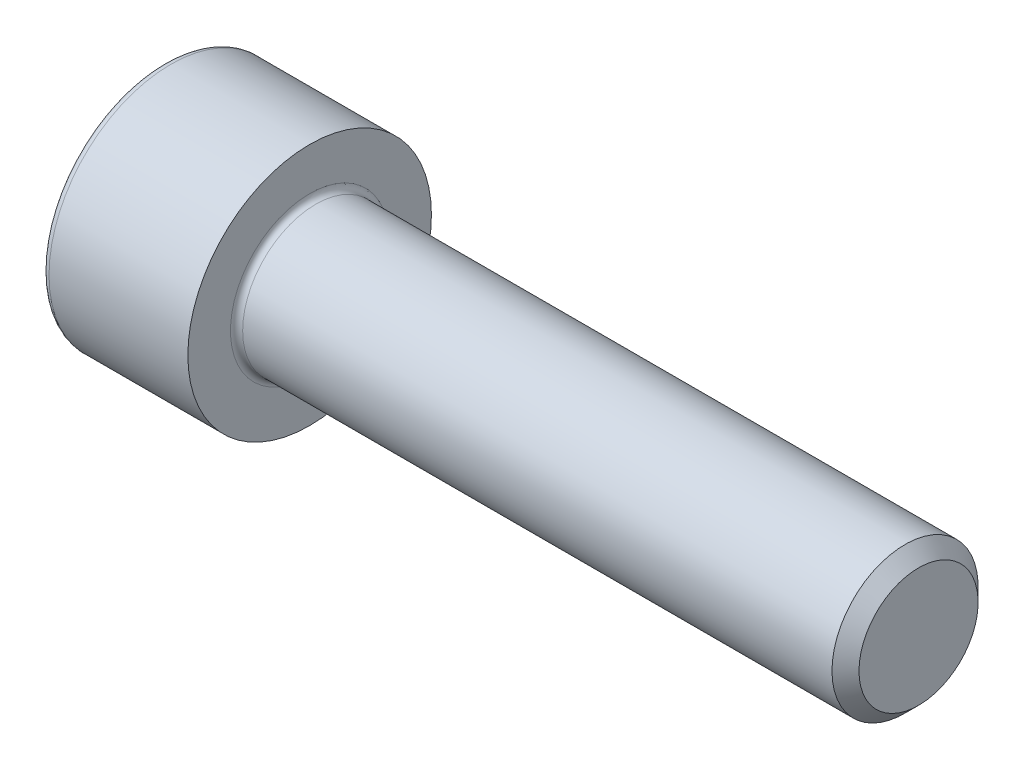
ISO-10303-21;
HEADER;
FILE_DESCRIPTION(('STEP AP214'),'2;1');
FILE_NAME('part.step','',(''),(''),'','','');
FILE_SCHEMA(('AUTOMOTIVE_DESIGN { 1 0 10303 214 1 1 1 1 }'));
ENDSEC;
DATA;
#1=APPLICATION_CONTEXT('core data for automotive mechanical design processes');
#2=APPLICATION_PROTOCOL_DEFINITION('international standard','automotive_design',2000,#1);
#3=PRODUCT_CONTEXT('',#1,'mechanical');
#4=PRODUCT('Part','Part','',(#3));
#5=PRODUCT_RELATED_PRODUCT_CATEGORY('part','',(#4));
#6=PRODUCT_DEFINITION_FORMATION('','',#4);
#7=PRODUCT_DEFINITION_CONTEXT('part definition',#1,'design');
#8=PRODUCT_DEFINITION('design','',#6,#7);
#9=PRODUCT_DEFINITION_SHAPE('','',#8);
#10=(LENGTH_UNIT() NAMED_UNIT(*) SI_UNIT(.MILLI.,.METRE.));
#11=(NAMED_UNIT(*) PLANE_ANGLE_UNIT() SI_UNIT($,.RADIAN.));
#12=(NAMED_UNIT(*) SI_UNIT($,.STERADIAN.) SOLID_ANGLE_UNIT());
#13=UNCERTAINTY_MEASURE_WITH_UNIT(LENGTH_MEASURE(1.E-05),#10,'distance_accuracy_value','');
#14=(GEOMETRIC_REPRESENTATION_CONTEXT(3) GLOBAL_UNCERTAINTY_ASSIGNED_CONTEXT((#13)) GLOBAL_UNIT_ASSIGNED_CONTEXT((#10,
#11,#12)) REPRESENTATION_CONTEXT('',''));
#15=CARTESIAN_POINT('',(0.,0.,0.));
#16=DIRECTION('',(0.,0.,1.));
#17=DIRECTION('',(1.,0.,0.));
#18=AXIS2_PLACEMENT_3D('',#15,#16,#17);
#19=CARTESIAN_POINT('',(0.,0.,0.));
#20=DIRECTION('',(-1.,0.,0.));
#21=DIRECTION('',(0.,0.,1.));
#22=AXIS2_PLACEMENT_3D('',#19,#20,#21);
#23=PLANE('',#22);
#24=DIRECTION('',(0.,-0.499999999999999,0.866025403784439));
#25=VECTOR('',#24,1.);
#26=CARTESIAN_POINT('',(0.,2.93524876856005,0.));
#27=LINE('',#26,#25);
#28=CARTESIAN_POINT('',(0.,2.93524876856005,0.));
#29=VERTEX_POINT('',#28);
#30=CARTESIAN_POINT('',(0.,1.46762438428003,2.54199999999999));
#31=VERTEX_POINT('',#30);
#32=EDGE_CURVE('E260',#29,#31,#27,.T.);
#33=ORIENTED_EDGE('',*,*,#32,.T.);
#34=DIRECTION('',(0.,1.,0.));
#35=VECTOR('',#34,1.);
#36=CARTESIAN_POINT('',(0.,-1.46762438428003,2.542));
#37=LINE('',#36,#35);
#38=CARTESIAN_POINT('',(0.,-1.46762438428003,2.542));
#39=VERTEX_POINT('',#38);
#40=EDGE_CURVE('E132',#39,#31,#37,.T.);
#41=ORIENTED_EDGE('',*,*,#40,.F.);
#42=DIRECTION('',(0.,-0.500000000000001,-0.866025403784438));
#43=VECTOR('',#42,1.);
#44=CARTESIAN_POINT('',(0.,-1.46762438428003,2.542));
#45=LINE('',#44,#43);
#46=CARTESIAN_POINT('',(0.,-2.93524876856006,0.));
#47=VERTEX_POINT('',#46);
#48=EDGE_CURVE('E263',#39,#47,#45,.T.);
#49=ORIENTED_EDGE('',*,*,#48,.T.);
#50=DIRECTION('',(0.,0.499999999999999,-0.866025403784439));
#51=VECTOR('',#50,1.);
#52=CARTESIAN_POINT('',(0.,-2.93524876856006,0.));
#53=LINE('',#52,#51);
#54=CARTESIAN_POINT('',(0.,-1.46762438428004,-2.542));
#55=VERTEX_POINT('',#54);
#56=EDGE_CURVE('E266',#47,#55,#53,.T.);
#57=ORIENTED_EDGE('',*,*,#56,.T.);
#58=DIRECTION('',(0.,-1.,0.));
#59=VECTOR('',#58,1.);
#60=CARTESIAN_POINT('',(0.,1.46762438428002,-2.542));
#61=LINE('',#60,#59);
#62=CARTESIAN_POINT('',(0.,1.46762438428002,-2.542));
#63=VERTEX_POINT('',#62);
#64=EDGE_CURVE('E269',#63,#55,#61,.T.);
#65=ORIENTED_EDGE('',*,*,#64,.F.);
#66=DIRECTION('',(0.,-0.500000000000001,-0.866025403784438));
#67=VECTOR('',#66,1.);
#68=CARTESIAN_POINT('',(0.,2.93524876856005,0.));
#69=LINE('',#68,#67);
#70=EDGE_CURVE('E127',#29,#63,#69,.T.);
#71=ORIENTED_EDGE('',*,*,#70,.F.);
#72=EDGE_LOOP('',(#33,#41,#49,#57,#65,#71));
#73=FACE_BOUND('',#72,.T.);
#74=CARTESIAN_POINT('',(0.,0.,0.));
#75=DIRECTION('',(-1.,0.,0.));
#76=DIRECTION('',(0.,0.,1.));
#77=AXIS2_PLACEMENT_3D('',#74,#75,#76);
#78=CIRCLE('',#77,4.7);
#79=CARTESIAN_POINT('',(0.,0.,4.7));
#80=VERTEX_POINT('',#79);
#81=EDGE_CURVE('E44',#80,#80,#78,.T.);
#82=ORIENTED_EDGE('',*,*,#81,.T.);
#83=EDGE_LOOP('',(#82));
#84=FACE_BOUND('',#83,.T.);
#85=ADVANCED_FACE('F36',(#73,#84),#23,.T.);
#86=CARTESIAN_POINT('',(-31.75,0.,0.));
#87=DIRECTION('',(-1.,0.,0.));
#88=DIRECTION('',(0.,0.,1.));
#89=AXIS2_PLACEMENT_3D('',#86,#87,#88);
#90=CYLINDRICAL_SURFACE('',#89,5.);
#91=CARTESIAN_POINT('',(0.300000000000002,0.,0.));
#92=DIRECTION('',(-1.,0.,0.));
#93=DIRECTION('',(0.,0.,1.));
#94=AXIS2_PLACEMENT_3D('',#91,#92,#93);
#95=CIRCLE('',#94,5.);
#96=CARTESIAN_POINT('',(0.300000000000002,0.,5.));
#97=VERTEX_POINT('',#96);
#98=EDGE_CURVE('E11',#97,#97,#95,.F.);
#99=ORIENTED_EDGE('',*,*,#98,.T.);
#100=EDGE_LOOP('',(#99));
#101=FACE_BOUND('',#100,.T.);
#102=CARTESIAN_POINT('',(6.,0.,0.));
#103=DIRECTION('',(-1.,0.,0.));
#104=DIRECTION('',(0.,0.,1.));
#105=AXIS2_PLACEMENT_3D('',#102,#103,#104);
#106=CIRCLE('',#105,5.);
#107=CARTESIAN_POINT('',(6.,0.,5.));
#108=VERTEX_POINT('',#107);
#109=EDGE_CURVE('E150',#108,#108,#106,.T.);
#110=ORIENTED_EDGE('',*,*,#109,.T.);
#111=EDGE_LOOP('',(#110));
#112=FACE_BOUND('',#111,.T.);
#113=ADVANCED_FACE('F174',(#101,#112),#90,.T.);
#114=CARTESIAN_POINT('',(6.,5.,0.));
#115=DIRECTION('',(1.,0.,0.));
#116=DIRECTION('',(0.,0.,-1.));
#117=AXIS2_PLACEMENT_3D('',#114,#115,#116);
#118=PLANE('',#117);
#119=CARTESIAN_POINT('',(6.,0.,0.));
#120=DIRECTION('',(1.,0.,0.));
#121=DIRECTION('',(0.,0.,-1.));
#122=AXIS2_PLACEMENT_3D('',#119,#120,#121);
#123=CIRCLE('',#122,3.24999999999998);
#124=CARTESIAN_POINT('',(6.,0.,-3.24999999999998));
#125=VERTEX_POINT('',#124);
#126=EDGE_CURVE('E153',#125,#125,#123,.F.);
#127=ORIENTED_EDGE('',*,*,#126,.T.);
#128=EDGE_LOOP('',(#127));
#129=FACE_BOUND('',#128,.T.);
#130=ORIENTED_EDGE('',*,*,#109,.F.);
#131=EDGE_LOOP('',(#130));
#132=FACE_BOUND('',#131,.T.);
#133=ADVANCED_FACE('F180',(#129,#132),#118,.T.);
#134=CARTESIAN_POINT('',(-31.75,0.,0.));
#135=DIRECTION('',(-1.,0.,0.));
#136=DIRECTION('',(0.,0.,1.));
#137=AXIS2_PLACEMENT_3D('',#134,#135,#136);
#138=CYLINDRICAL_SURFACE('',#137,2.99999999999998);
#139=CARTESIAN_POINT('',(6.25,0.,0.));
#140=DIRECTION('',(1.,0.,0.));
#141=DIRECTION('',(0.,0.,-1.));
#142=AXIS2_PLACEMENT_3D('',#139,#140,#141);
#143=CIRCLE('',#142,2.99999999999998);
#144=CARTESIAN_POINT('',(6.25,0.,-2.99999999999998));
#145=VERTEX_POINT('',#144);
#146=EDGE_CURVE('E156',#145,#145,#143,.T.);
#147=ORIENTED_EDGE('',*,*,#146,.T.);
#148=EDGE_LOOP('',(#147));
#149=FACE_BOUND('',#148,.T.);
#150=CARTESIAN_POINT('',(30.4455,0.,0.));
#151=DIRECTION('',(-1.,0.,0.));
#152=DIRECTION('',(0.,0.,1.));
#153=AXIS2_PLACEMENT_3D('',#150,#151,#152);
#154=CIRCLE('',#153,2.99999999999995);
#155=CARTESIAN_POINT('',(30.4455,0.,2.99999999999995));
#156=VERTEX_POINT('',#155);
#157=EDGE_CURVE('E147',#156,#156,#154,.T.);
#158=ORIENTED_EDGE('',*,*,#157,.T.);
#159=EDGE_LOOP('',(#158));
#160=FACE_BOUND('',#159,.T.);
#161=ADVANCED_FACE('F186',(#149,#160),#138,.T.);
#162=CARTESIAN_POINT('',(31.,0.,0.));
#163=DIRECTION('',(-1.,0.,0.));
#164=DIRECTION('',(0.,0.,1.));
#165=AXIS2_PLACEMENT_3D('',#162,#163,#164);
#166=CONICAL_SURFACE('',#165,2.4455,0.785398163397388);
#167=ORIENTED_EDGE('',*,*,#157,.F.);
#168=EDGE_LOOP('',(#167));
#169=FACE_BOUND('',#168,.T.);
#170=CARTESIAN_POINT('',(31.,0.,0.));
#171=DIRECTION('',(-1.,0.,0.));
#172=DIRECTION('',(0.,0.,1.));
#173=AXIS2_PLACEMENT_3D('',#170,#171,#172);
#174=CIRCLE('',#173,2.4455);
#175=CARTESIAN_POINT('',(31.,0.,2.4455));
#176=VERTEX_POINT('',#175);
#177=EDGE_CURVE('E143',#176,#176,#174,.T.);
#178=ORIENTED_EDGE('',*,*,#177,.T.);
#179=EDGE_LOOP('',(#178));
#180=FACE_BOUND('',#179,.T.);
#181=ADVANCED_FACE('F190',(#169,#180),#166,.T.);
#182=CARTESIAN_POINT('',(31.,2.4455,0.));
#183=DIRECTION('',(1.,0.,0.));
#184=DIRECTION('',(0.,0.,-1.));
#185=AXIS2_PLACEMENT_3D('',#182,#183,#184);
#186=PLANE('',#185);
#187=ORIENTED_EDGE('',*,*,#177,.F.);
#188=EDGE_LOOP('',(#187));
#189=FACE_BOUND('',#188,.T.);
#190=ADVANCED_FACE('F170',(#189),#186,.T.);
#191=CARTESIAN_POINT('',(6.25,0.,0.));
#192=DIRECTION('',(1.,0.,0.));
#193=DIRECTION('',(0.,0.,-1.));
#194=AXIS2_PLACEMENT_3D('',#191,#192,#193);
#195=TOROIDAL_SURFACE('',#194,3.24999999999998,0.25);
#196=ORIENTED_EDGE('',*,*,#146,.F.);
#197=EDGE_LOOP('',(#196));
#198=FACE_BOUND('',#197,.T.);
#199=ORIENTED_EDGE('',*,*,#126,.F.);
#200=EDGE_LOOP('',(#199));
#201=FACE_BOUND('',#200,.T.);
#202=ADVANCED_FACE('F163',(#198,#201),#195,.F.);
#203=CARTESIAN_POINT('',(0.300000000000002,0.,0.));
#204=DIRECTION('',(-1.,0.,0.));
#205=DIRECTION('',(0.,0.,1.));
#206=AXIS2_PLACEMENT_3D('',#203,#204,#205);
#207=TOROIDAL_SURFACE('',#206,4.7,0.3);
#208=ORIENTED_EDGE('',*,*,#98,.F.);
#209=EDGE_LOOP('',(#208));
#210=FACE_BOUND('',#209,.T.);
#211=ORIENTED_EDGE('',*,*,#81,.F.);
#212=EDGE_LOOP('',(#211));
#213=FACE_BOUND('',#212,.T.);
#214=ADVANCED_FACE('F38',(#210,#213),#207,.T.);
#215=CARTESIAN_POINT('',(3.,2.93524876856005,0.));
#216=DIRECTION('',(0.,-0.866025403784439,-0.499999999999999));
#217=DIRECTION('',(0.,0.499999999999999,-0.866025403784439));
#218=AXIS2_PLACEMENT_3D('',#215,#216,#217);
#219=PLANE('',#218);
#220=ORIENTED_EDGE('',*,*,#32,.F.);
#221=DIRECTION('',(-1.,0.,0.));
#222=VECTOR('',#221,1.);
#223=CARTESIAN_POINT('',(3.,2.93524876856005,0.));
#224=LINE('',#223,#222);
#225=CARTESIAN_POINT('',(3.,2.93524876856005,0.));
#226=VERTEX_POINT('',#225);
#227=EDGE_CURVE('E250',#226,#29,#224,.T.);
#228=ORIENTED_EDGE('',*,*,#227,.F.);
#229=DIRECTION('',(0.,-0.499999999999999,0.866025403784439));
#230=VECTOR('',#229,1.);
#231=CARTESIAN_POINT('',(3.,2.93524876856005,0.));
#232=LINE('',#231,#230);
#233=CARTESIAN_POINT('',(3.,2.20143657642004,1.271));
#234=VERTEX_POINT('',#233);
#235=EDGE_CURVE('E119',#226,#234,#232,.T.);
#236=ORIENTED_EDGE('',*,*,#235,.T.);
#237=CARTESIAN_POINT('',(3.,1.46762438428003,2.54199999999999));
#238=VERTEX_POINT('',#237);
#239=EDGE_CURVE('E110',#234,#238,#232,.T.);
#240=ORIENTED_EDGE('',*,*,#239,.T.);
#241=DIRECTION('',(-1.,0.,0.));
#242=VECTOR('',#241,1.);
#243=CARTESIAN_POINT('',(3.,1.46762438428003,2.54199999999999));
#244=LINE('',#243,#242);
#245=EDGE_CURVE('E124',#238,#31,#244,.T.);
#246=ORIENTED_EDGE('',*,*,#245,.T.);
#247=EDGE_LOOP('',(#220,#228,#236,#240,#246));
#248=FACE_BOUND('',#247,.T.);
#249=ADVANCED_FACE('F123',(#248),#219,.T.);
#250=CARTESIAN_POINT('',(3.,-1.46762438428003,2.542));
#251=DIRECTION('',(0.,0.,1.));
#252=DIRECTION('',(0.,-1.,0.));
#253=AXIS2_PLACEMENT_3D('',#250,#251,#252);
#254=PLANE('',#253);
#255=ORIENTED_EDGE('',*,*,#40,.T.);
#256=ORIENTED_EDGE('',*,*,#245,.F.);
#257=DIRECTION('',(0.,1.,0.));
#258=VECTOR('',#257,1.);
#259=CARTESIAN_POINT('',(3.,-1.46762438428003,2.542));
#260=LINE('',#259,#258);
#261=CARTESIAN_POINT('',(3.,0.,2.542));
#262=VERTEX_POINT('',#261);
#263=EDGE_CURVE('E107',#262,#238,#260,.T.);
#264=ORIENTED_EDGE('',*,*,#263,.F.);
#265=CARTESIAN_POINT('',(3.,-1.46762438428003,2.542));
#266=VERTEX_POINT('',#265);
#267=EDGE_CURVE('E118',#266,#262,#260,.T.);
#268=ORIENTED_EDGE('',*,*,#267,.F.);
#269=DIRECTION('',(-1.,0.,0.));
#270=VECTOR('',#269,1.);
#271=CARTESIAN_POINT('',(3.,-1.46762438428003,2.542));
#272=LINE('',#271,#270);
#273=EDGE_CURVE('E134',#266,#39,#272,.T.);
#274=ORIENTED_EDGE('',*,*,#273,.T.);
#275=EDGE_LOOP('',(#255,#256,#264,#268,#274));
#276=FACE_BOUND('',#275,.T.);
#277=ADVANCED_FACE('F129',(#276),#254,.F.);
#278=CARTESIAN_POINT('',(3.,-1.46762438428003,2.542));
#279=DIRECTION('',(0.,0.866025403784438,-0.500000000000001));
#280=DIRECTION('',(0.,0.500000000000001,0.866025403784438));
#281=AXIS2_PLACEMENT_3D('',#278,#279,#280);
#282=PLANE('',#281);
#283=ORIENTED_EDGE('',*,*,#48,.F.);
#284=ORIENTED_EDGE('',*,*,#273,.F.);
#285=DIRECTION('',(0.,-0.500000000000001,-0.866025403784438));
#286=VECTOR('',#285,1.);
#287=CARTESIAN_POINT('',(3.,-1.46762438428003,2.542));
#288=LINE('',#287,#286);
#289=CARTESIAN_POINT('',(3.,-2.20143657642004,1.271));
#290=VERTEX_POINT('',#289);
#291=EDGE_CURVE('E289',#266,#290,#288,.T.);
#292=ORIENTED_EDGE('',*,*,#291,.T.);
#293=CARTESIAN_POINT('',(3.,-2.93524876856006,0.));
#294=VERTEX_POINT('',#293);
#295=EDGE_CURVE('E278',#290,#294,#288,.T.);
#296=ORIENTED_EDGE('',*,*,#295,.T.);
#297=DIRECTION('',(-1.,0.,0.));
#298=VECTOR('',#297,1.);
#299=CARTESIAN_POINT('',(3.,-2.93524876856006,0.));
#300=LINE('',#299,#298);
#301=EDGE_CURVE('E139',#294,#47,#300,.T.);
#302=ORIENTED_EDGE('',*,*,#301,.T.);
#303=EDGE_LOOP('',(#283,#284,#292,#296,#302));
#304=FACE_BOUND('',#303,.T.);
#305=ADVANCED_FACE('F204',(#304),#282,.T.);
#306=CARTESIAN_POINT('',(3.,-2.93524876856006,0.));
#307=DIRECTION('',(0.,0.866025403784439,0.499999999999999));
#308=DIRECTION('',(0.,-0.499999999999999,0.866025403784439));
#309=AXIS2_PLACEMENT_3D('',#306,#307,#308);
#310=PLANE('',#309);
#311=ORIENTED_EDGE('',*,*,#56,.F.);
#312=ORIENTED_EDGE('',*,*,#301,.F.);
#313=DIRECTION('',(0.,0.499999999999999,-0.866025403784439));
#314=VECTOR('',#313,1.);
#315=CARTESIAN_POINT('',(3.,-2.93524876856006,0.));
#316=LINE('',#315,#314);
#317=CARTESIAN_POINT('',(3.,-2.20143657642005,-1.271));
#318=VERTEX_POINT('',#317);
#319=EDGE_CURVE('E256',#294,#318,#316,.T.);
#320=ORIENTED_EDGE('',*,*,#319,.T.);
#321=CARTESIAN_POINT('',(3.,-1.46762438428004,-2.542));
#322=VERTEX_POINT('',#321);
#323=EDGE_CURVE('E288',#318,#322,#316,.T.);
#324=ORIENTED_EDGE('',*,*,#323,.T.);
#325=DIRECTION('',(-1.,0.,0.));
#326=VECTOR('',#325,1.);
#327=CARTESIAN_POINT('',(3.,-1.46762438428004,-2.542));
#328=LINE('',#327,#326);
#329=EDGE_CURVE('E249',#322,#55,#328,.T.);
#330=ORIENTED_EDGE('',*,*,#329,.T.);
#331=EDGE_LOOP('',(#311,#312,#320,#324,#330));
#332=FACE_BOUND('',#331,.T.);
#333=ADVANCED_FACE('F207',(#332),#310,.T.);
#334=CARTESIAN_POINT('',(3.,1.46762438428002,-2.542));
#335=DIRECTION('',(0.,0.,-1.));
#336=DIRECTION('',(0.,1.,0.));
#337=AXIS2_PLACEMENT_3D('',#334,#335,#336);
#338=PLANE('',#337);
#339=ORIENTED_EDGE('',*,*,#64,.T.);
#340=ORIENTED_EDGE('',*,*,#329,.F.);
#341=DIRECTION('',(0.,-1.,0.));
#342=VECTOR('',#341,1.);
#343=CARTESIAN_POINT('',(3.,1.46762438428002,-2.542));
#344=LINE('',#343,#342);
#345=CARTESIAN_POINT('',(3.,0.,-2.542));
#346=VERTEX_POINT('',#345);
#347=EDGE_CURVE('E253',#346,#322,#344,.T.);
#348=ORIENTED_EDGE('',*,*,#347,.F.);
#349=CARTESIAN_POINT('',(3.,1.46762438428002,-2.542));
#350=VERTEX_POINT('',#349);
#351=EDGE_CURVE('E51',#350,#346,#344,.T.);
#352=ORIENTED_EDGE('',*,*,#351,.F.);
#353=DIRECTION('',(-1.,0.,0.));
#354=VECTOR('',#353,1.);
#355=CARTESIAN_POINT('',(3.,1.46762438428002,-2.542));
#356=LINE('',#355,#354);
#357=EDGE_CURVE('E246',#350,#63,#356,.T.);
#358=ORIENTED_EDGE('',*,*,#357,.T.);
#359=EDGE_LOOP('',(#339,#340,#348,#352,#358));
#360=FACE_BOUND('',#359,.T.);
#361=ADVANCED_FACE('F211',(#360),#338,.F.);
#362=CARTESIAN_POINT('',(3.,2.93524876856005,0.));
#363=DIRECTION('',(0.,0.866025403784438,-0.500000000000001));
#364=DIRECTION('',(0.,0.500000000000001,0.866025403784438));
#365=AXIS2_PLACEMENT_3D('',#362,#363,#364);
#366=PLANE('',#365);
#367=ORIENTED_EDGE('',*,*,#70,.T.);
#368=ORIENTED_EDGE('',*,*,#357,.F.);
#369=DIRECTION('',(0.,-0.500000000000001,-0.866025403784438));
#370=VECTOR('',#369,1.);
#371=CARTESIAN_POINT('',(3.,2.93524876856005,0.));
#372=LINE('',#371,#370);
#373=CARTESIAN_POINT('',(3.,2.20143657642004,-1.271));
#374=VERTEX_POINT('',#373);
#375=EDGE_CURVE('E236',#374,#350,#372,.T.);
#376=ORIENTED_EDGE('',*,*,#375,.F.);
#377=EDGE_CURVE('E242',#226,#374,#372,.T.);
#378=ORIENTED_EDGE('',*,*,#377,.F.);
#379=ORIENTED_EDGE('',*,*,#227,.T.);
#380=EDGE_LOOP('',(#367,#368,#376,#378,#379));
#381=FACE_BOUND('',#380,.T.);
#382=ADVANCED_FACE('F215',(#381),#366,.F.);
#383=CARTESIAN_POINT('',(3.,2.93524876856005,0.));
#384=DIRECTION('',(1.,0.,0.));
#385=DIRECTION('',(0.,0.,-1.));
#386=AXIS2_PLACEMENT_3D('',#383,#384,#385);
#387=PLANE('',#386);
#388=ORIENTED_EDGE('',*,*,#347,.T.);
#389=ORIENTED_EDGE('',*,*,#323,.F.);
#390=CARTESIAN_POINT('',(3.,0.,0.));
#391=DIRECTION('',(-1.,0.,0.));
#392=DIRECTION('',(0.,0.,1.));
#393=AXIS2_PLACEMENT_3D('',#390,#391,#392);
#394=CIRCLE('',#393,2.542);
#395=EDGE_CURVE('E284',#346,#318,#394,.T.);
#396=ORIENTED_EDGE('',*,*,#395,.F.);
#397=EDGE_LOOP('',(#388,#389,#396));
#398=FACE_BOUND('',#397,.T.);
#399=ADVANCED_FACE('F219',(#398),#387,.F.);
#400=ORIENTED_EDGE('',*,*,#319,.F.);
#401=ORIENTED_EDGE('',*,*,#295,.F.);
#402=EDGE_CURVE('E137',#318,#290,#394,.T.);
#403=ORIENTED_EDGE('',*,*,#402,.F.);
#404=EDGE_LOOP('',(#400,#401,#403));
#405=FACE_BOUND('',#404,.T.);
#406=ADVANCED_FACE('F222',(#405),#387,.F.);
#407=ORIENTED_EDGE('',*,*,#291,.F.);
#408=ORIENTED_EDGE('',*,*,#267,.T.);
#409=EDGE_CURVE('E133',#290,#262,#394,.T.);
#410=ORIENTED_EDGE('',*,*,#409,.F.);
#411=EDGE_LOOP('',(#407,#408,#410));
#412=FACE_BOUND('',#411,.T.);
#413=ADVANCED_FACE('F227',(#412),#387,.F.);
#414=ORIENTED_EDGE('',*,*,#263,.T.);
#415=ORIENTED_EDGE('',*,*,#239,.F.);
#416=EDGE_CURVE('E113',#262,#234,#394,.T.);
#417=ORIENTED_EDGE('',*,*,#416,.F.);
#418=EDGE_LOOP('',(#414,#415,#417));
#419=FACE_BOUND('',#418,.T.);
#420=ADVANCED_FACE('F109',(#419),#387,.F.);
#421=ORIENTED_EDGE('',*,*,#235,.F.);
#422=ORIENTED_EDGE('',*,*,#377,.T.);
#423=EDGE_CURVE('E144',#234,#374,#394,.T.);
#424=ORIENTED_EDGE('',*,*,#423,.F.);
#425=EDGE_LOOP('',(#421,#422,#424));
#426=FACE_BOUND('',#425,.T.);
#427=ADVANCED_FACE('F230',(#426),#387,.F.);
#428=ORIENTED_EDGE('',*,*,#375,.T.);
#429=ORIENTED_EDGE('',*,*,#351,.T.);
#430=EDGE_CURVE('E239',#374,#346,#394,.T.);
#431=ORIENTED_EDGE('',*,*,#430,.F.);
#432=EDGE_LOOP('',(#428,#429,#431));
#433=FACE_BOUND('',#432,.T.);
#434=ADVANCED_FACE('F200',(#433),#387,.F.);
#435=CARTESIAN_POINT('',(3.,0.,0.));
#436=DIRECTION('',(-1.,0.,0.));
#437=DIRECTION('',(0.,0.,1.));
#438=AXIS2_PLACEMENT_3D('',#435,#436,#437);
#439=CONICAL_SURFACE('',#438,2.542,1.04719755119659);
#440=CARTESIAN_POINT('',(4.46762438428005,0.,0.));
#441=VERTEX_POINT('',#440);
#442=VERTEX_LOOP('',#441);
#443=FACE_BOUND('',#442,.T.);
#444=ORIENTED_EDGE('',*,*,#416,.T.);
#445=ORIENTED_EDGE('',*,*,#423,.T.);
#446=ORIENTED_EDGE('',*,*,#430,.T.);
#447=ORIENTED_EDGE('',*,*,#395,.T.);
#448=ORIENTED_EDGE('',*,*,#402,.T.);
#449=ORIENTED_EDGE('',*,*,#409,.T.);
#450=EDGE_LOOP('',(#444,#445,#446,#447,#448,#449));
#451=FACE_BOUND('',#450,.T.);
#452=ADVANCED_FACE('F198',(#443,#451),#439,.F.);
#453=CLOSED_SHELL('',(#85,#113,#133,#161,#181,#190,#202,#214,#249,#277,#305,#333,#361,#382,#399,
#406,#413,#420,#427,#434,#452));
#454=MANIFOLD_SOLID_BREP('B2',#453);
#455=ADVANCED_BREP_SHAPE_REPRESENTATION('',(#18,#454),#14);
#456=SHAPE_DEFINITION_REPRESENTATION(#9,#455);
ENDSEC;
END-ISO-10303-21;
